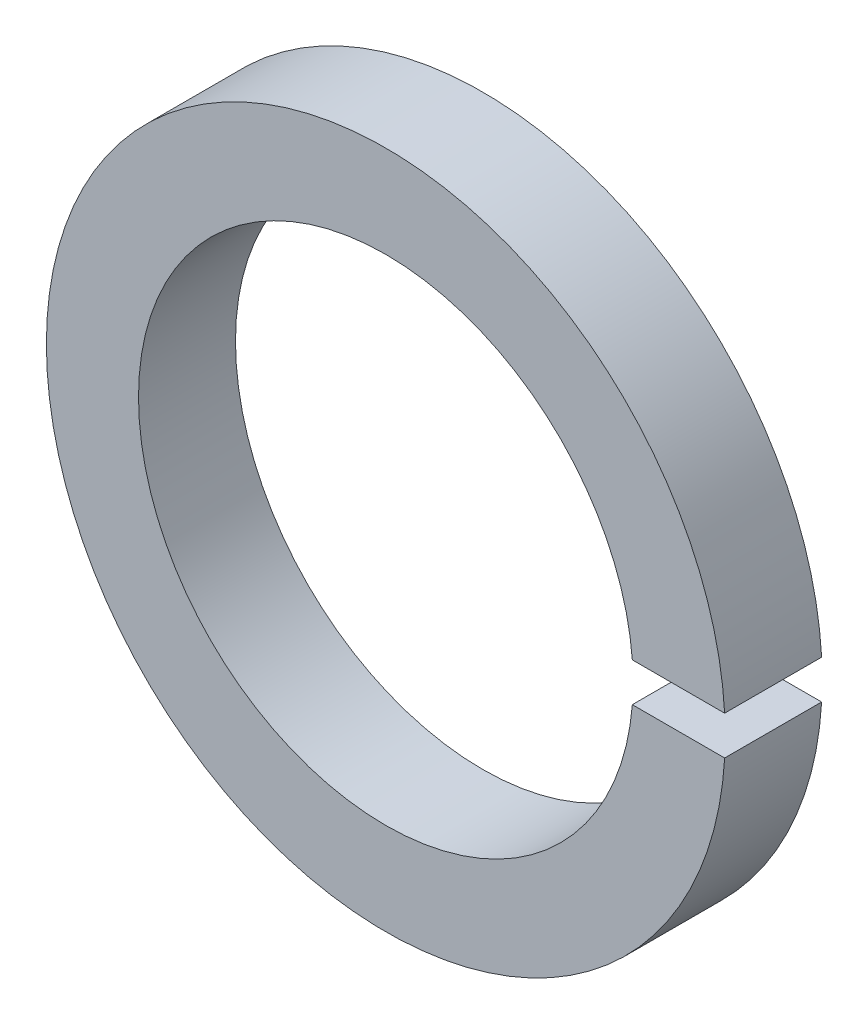
ISO-10303-21;
HEADER;
FILE_DESCRIPTION(('STEP AP214'),'2;1');
FILE_NAME('part.step','',(''),(''),'','','');
FILE_SCHEMA(('AUTOMOTIVE_DESIGN { 1 0 10303 214 1 1 1 1 }'));
ENDSEC;
DATA;
#1=APPLICATION_CONTEXT('core data for automotive mechanical design processes');
#2=APPLICATION_PROTOCOL_DEFINITION('international standard','automotive_design',2000,#1);
#3=PRODUCT_CONTEXT('',#1,'mechanical');
#4=PRODUCT('Part','Part','',(#3));
#5=PRODUCT_RELATED_PRODUCT_CATEGORY('part','',(#4));
#6=PRODUCT_DEFINITION_FORMATION('','',#4);
#7=PRODUCT_DEFINITION_CONTEXT('part definition',#1,'design');
#8=PRODUCT_DEFINITION('design','',#6,#7);
#9=PRODUCT_DEFINITION_SHAPE('','',#8);
#10=(LENGTH_UNIT() NAMED_UNIT(*) SI_UNIT(.MILLI.,.METRE.));
#11=(NAMED_UNIT(*) PLANE_ANGLE_UNIT() SI_UNIT($,.RADIAN.));
#12=(NAMED_UNIT(*) SI_UNIT($,.STERADIAN.) SOLID_ANGLE_UNIT());
#13=UNCERTAINTY_MEASURE_WITH_UNIT(LENGTH_MEASURE(1.E-05),#10,'distance_accuracy_value','');
#14=(GEOMETRIC_REPRESENTATION_CONTEXT(3) GLOBAL_UNCERTAINTY_ASSIGNED_CONTEXT((#13)) GLOBAL_UNIT_ASSIGNED_CONTEXT((#10,
#11,#12)) REPRESENTATION_CONTEXT('',''));
#15=CARTESIAN_POINT('',(0.,0.,0.));
#16=DIRECTION('',(0.,0.,1.));
#17=DIRECTION('',(1.,0.,0.));
#18=AXIS2_PLACEMENT_3D('',#15,#16,#17);
#19=CARTESIAN_POINT('',(0.,0.,0.));
#20=DIRECTION('',(0.,0.,1.));
#21=DIRECTION('',(1.,0.,0.));
#22=AXIS2_PLACEMENT_3D('',#19,#20,#21);
#23=PLANE('',#22);
#24=DIRECTION('',(1.,0.,0.));
#25=VECTOR('',#24,1.);
#26=CARTESIAN_POINT('',(0.,0.2,0.));
#27=LINE('',#26,#25);
#28=CARTESIAN_POINT('',(2.54214476377723,0.2,0.));
#29=VERTEX_POINT('',#28);
#30=CARTESIAN_POINT('',(3.49428104193123,0.2,0.));
#31=VERTEX_POINT('',#30);
#32=EDGE_CURVE('E64',#29,#31,#27,.T.);
#33=ORIENTED_EDGE('',*,*,#32,.F.);
#34=CARTESIAN_POINT('',(0.,0.,0.));
#35=DIRECTION('',(0.,0.,-1.));
#36=DIRECTION('',(-1.,0.,0.));
#37=AXIS2_PLACEMENT_3D('',#34,#35,#36);
#38=CIRCLE('',#37,2.55);
#39=CARTESIAN_POINT('',(2.54214476377723,-0.2,0.));
#40=VERTEX_POINT('',#39);
#41=EDGE_CURVE('E68',#29,#40,#38,.F.);
#42=ORIENTED_EDGE('',*,*,#41,.T.);
#43=DIRECTION('',(1.,0.,0.));
#44=VECTOR('',#43,1.);
#45=CARTESIAN_POINT('',(2.54214476377723,-0.2,0.));
#46=LINE('',#45,#44);
#47=CARTESIAN_POINT('',(3.49428104193123,-0.2,0.));
#48=VERTEX_POINT('',#47);
#49=EDGE_CURVE('E66',#40,#48,#46,.T.);
#50=ORIENTED_EDGE('',*,*,#49,.T.);
#51=CARTESIAN_POINT('',(0.,0.,0.));
#52=DIRECTION('',(0.,0.,-1.));
#53=DIRECTION('',(-1.,0.,0.));
#54=AXIS2_PLACEMENT_3D('',#51,#52,#53);
#55=CIRCLE('',#54,3.5);
#56=EDGE_CURVE('E20',#31,#48,#55,.F.);
#57=ORIENTED_EDGE('',*,*,#56,.F.);
#58=EDGE_LOOP('',(#33,#42,#50,#57));
#59=FACE_BOUND('',#58,.T.);
#60=ADVANCED_FACE('F17',(#59),#23,.F.);
#61=CARTESIAN_POINT('',(0.,0.,1.));
#62=DIRECTION('',(0.,0.,-1.));
#63=DIRECTION('',(-1.,0.,0.));
#64=AXIS2_PLACEMENT_3D('',#61,#62,#63);
#65=CYLINDRICAL_SURFACE('',#64,3.5);
#66=ORIENTED_EDGE('',*,*,#56,.T.);
#67=DIRECTION('',(0.,0.,-1.));
#68=VECTOR('',#67,1.);
#69=CARTESIAN_POINT('',(3.49428104193123,-0.2,1.));
#70=LINE('',#69,#68);
#71=CARTESIAN_POINT('',(3.49428104193123,-0.2,1.));
#72=VERTEX_POINT('',#71);
#73=EDGE_CURVE('E58',#48,#72,#70,.F.);
#74=ORIENTED_EDGE('',*,*,#73,.T.);
#75=CARTESIAN_POINT('',(0.,0.,1.));
#76=DIRECTION('',(0.,0.,-1.));
#77=DIRECTION('',(-1.,0.,0.));
#78=AXIS2_PLACEMENT_3D('',#75,#76,#77);
#79=CIRCLE('',#78,3.5);
#80=CARTESIAN_POINT('',(3.49428104193123,0.2,1.));
#81=VERTEX_POINT('',#80);
#82=EDGE_CURVE('E81',#81,#72,#79,.F.);
#83=ORIENTED_EDGE('',*,*,#82,.F.);
#84=DIRECTION('',(0.,0.,1.));
#85=VECTOR('',#84,1.);
#86=CARTESIAN_POINT('',(3.49428104193123,0.2,1.));
#87=LINE('',#86,#85);
#88=EDGE_CURVE('E61',#81,#31,#87,.F.);
#89=ORIENTED_EDGE('',*,*,#88,.T.);
#90=EDGE_LOOP('',(#66,#74,#83,#89));
#91=FACE_BOUND('',#90,.T.);
#92=ADVANCED_FACE('F56',(#91),#65,.T.);
#93=CARTESIAN_POINT('',(2.54214476377723,-0.2,1.));
#94=DIRECTION('',(0.,-1.,0.));
#95=DIRECTION('',(0.,0.,-1.));
#96=AXIS2_PLACEMENT_3D('',#93,#94,#95);
#97=PLANE('',#96);
#98=DIRECTION('',(0.,0.,-1.));
#99=VECTOR('',#98,1.);
#100=CARTESIAN_POINT('',(2.54214476377723,-0.199999999999999,1.));
#101=LINE('',#100,#99);
#102=CARTESIAN_POINT('',(2.54214476377723,-0.2,1.));
#103=VERTEX_POINT('',#102);
#104=EDGE_CURVE('E71',#40,#103,#101,.F.);
#105=ORIENTED_EDGE('',*,*,#104,.T.);
#106=DIRECTION('',(1.,0.,0.));
#107=VECTOR('',#106,1.);
#108=CARTESIAN_POINT('',(0.,-0.2,1.));
#109=LINE('',#108,#107);
#110=EDGE_CURVE('E74',#72,#103,#109,.F.);
#111=ORIENTED_EDGE('',*,*,#110,.F.);
#112=ORIENTED_EDGE('',*,*,#73,.F.);
#113=ORIENTED_EDGE('',*,*,#49,.F.);
#114=EDGE_LOOP('',(#105,#111,#112,#113));
#115=FACE_BOUND('',#114,.T.);
#116=ADVANCED_FACE('F73',(#115),#97,.F.);
#117=CARTESIAN_POINT('',(0.,0.,1.));
#118=DIRECTION('',(0.,0.,-1.));
#119=DIRECTION('',(-1.,0.,0.));
#120=AXIS2_PLACEMENT_3D('',#117,#118,#119);
#121=CYLINDRICAL_SURFACE('',#120,2.55);
#122=DIRECTION('',(0.,0.,1.));
#123=VECTOR('',#122,1.);
#124=CARTESIAN_POINT('',(2.54214476377723,0.2,1.));
#125=LINE('',#124,#123);
#126=CARTESIAN_POINT('',(2.54214476377723,0.2,1.));
#127=VERTEX_POINT('',#126);
#128=EDGE_CURVE('E82',#29,#127,#125,.T.);
#129=ORIENTED_EDGE('',*,*,#128,.T.);
#130=CARTESIAN_POINT('',(0.,0.,1.));
#131=DIRECTION('',(0.,0.,-1.));
#132=DIRECTION('',(-1.,0.,0.));
#133=AXIS2_PLACEMENT_3D('',#130,#131,#132);
#134=CIRCLE('',#133,2.55);
#135=EDGE_CURVE('E26',#103,#127,#134,.T.);
#136=ORIENTED_EDGE('',*,*,#135,.F.);
#137=ORIENTED_EDGE('',*,*,#104,.F.);
#138=ORIENTED_EDGE('',*,*,#41,.F.);
#139=EDGE_LOOP('',(#129,#136,#137,#138));
#140=FACE_BOUND('',#139,.T.);
#141=ADVANCED_FACE('F85',(#140),#121,.F.);
#142=CARTESIAN_POINT('',(2.54214476377723,0.2,1.));
#143=DIRECTION('',(0.,1.,0.));
#144=DIRECTION('',(0.,0.,1.));
#145=AXIS2_PLACEMENT_3D('',#142,#143,#144);
#146=PLANE('',#145);
#147=ORIENTED_EDGE('',*,*,#88,.F.);
#148=DIRECTION('',(1.,0.,0.));
#149=VECTOR('',#148,1.);
#150=CARTESIAN_POINT('',(0.,0.2,1.));
#151=LINE('',#150,#149);
#152=EDGE_CURVE('E10',#127,#81,#151,.T.);
#153=ORIENTED_EDGE('',*,*,#152,.F.);
#154=ORIENTED_EDGE('',*,*,#128,.F.);
#155=ORIENTED_EDGE('',*,*,#32,.T.);
#156=EDGE_LOOP('',(#147,#153,#154,#155));
#157=FACE_BOUND('',#156,.T.);
#158=ADVANCED_FACE('F91',(#157),#146,.F.);
#159=CARTESIAN_POINT('',(0.,0.,1.));
#160=DIRECTION('',(0.,0.,1.));
#161=DIRECTION('',(1.,0.,0.));
#162=AXIS2_PLACEMENT_3D('',#159,#160,#161);
#163=PLANE('',#162);
#164=ORIENTED_EDGE('',*,*,#135,.T.);
#165=ORIENTED_EDGE('',*,*,#152,.T.);
#166=ORIENTED_EDGE('',*,*,#82,.T.);
#167=ORIENTED_EDGE('',*,*,#110,.T.);
#168=EDGE_LOOP('',(#164,#165,#166,#167));
#169=FACE_BOUND('',#168,.T.);
#170=ADVANCED_FACE('F88',(#169),#163,.T.);
#171=CLOSED_SHELL('',(#60,#92,#116,#141,#158,#170));
#172=MANIFOLD_SOLID_BREP('B1',#171);
#173=ADVANCED_BREP_SHAPE_REPRESENTATION('',(#18,#172),#14);
#174=SHAPE_DEFINITION_REPRESENTATION(#9,#173);
ENDSEC;
END-ISO-10303-21;
